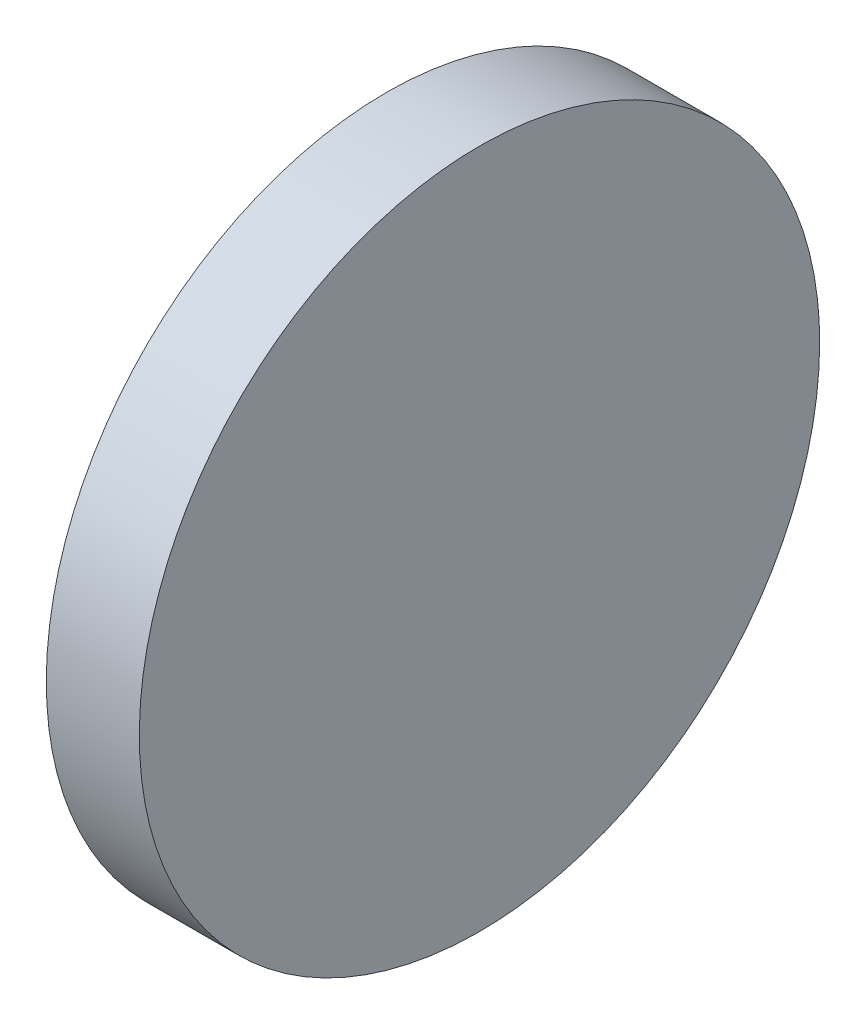
ISO-10303-21;
HEADER;
FILE_DESCRIPTION(('STEP AP214'),'2;1');
FILE_NAME('part.step','',(''),(''),'','','');
FILE_SCHEMA(('AUTOMOTIVE_DESIGN { 1 0 10303 214 1 1 1 1 }'));
ENDSEC;
DATA;
#1=APPLICATION_CONTEXT('core data for automotive mechanical design processes');
#2=APPLICATION_PROTOCOL_DEFINITION('international standard','automotive_design',2000,#1);
#3=PRODUCT_CONTEXT('',#1,'mechanical');
#4=PRODUCT('Part','Part','',(#3));
#5=PRODUCT_RELATED_PRODUCT_CATEGORY('part','',(#4));
#6=PRODUCT_DEFINITION_FORMATION('','',#4);
#7=PRODUCT_DEFINITION_CONTEXT('part definition',#1,'design');
#8=PRODUCT_DEFINITION('design','',#6,#7);
#9=PRODUCT_DEFINITION_SHAPE('','',#8);
#10=(LENGTH_UNIT() NAMED_UNIT(*) SI_UNIT(.MILLI.,.METRE.));
#11=(NAMED_UNIT(*) PLANE_ANGLE_UNIT() SI_UNIT($,.RADIAN.));
#12=(NAMED_UNIT(*) SI_UNIT($,.STERADIAN.) SOLID_ANGLE_UNIT());
#13=UNCERTAINTY_MEASURE_WITH_UNIT(LENGTH_MEASURE(1.E-05),#10,'distance_accuracy_value','');
#14=(GEOMETRIC_REPRESENTATION_CONTEXT(3) GLOBAL_UNCERTAINTY_ASSIGNED_CONTEXT((#13)) GLOBAL_UNIT_ASSIGNED_CONTEXT((#10,
#11,#12)) REPRESENTATION_CONTEXT('',''));
#15=CARTESIAN_POINT('',(0.,0.,0.));
#16=DIRECTION('',(0.,0.,1.));
#17=DIRECTION('',(1.,0.,0.));
#18=AXIS2_PLACEMENT_3D('',#15,#16,#17);
#19=CARTESIAN_POINT('',(1724.54363716145,190.588280016505,-62.7164754960861));
#20=CARTESIAN_POINT('',(1724.54363716145,188.737516544772,-62.7164754960861));
#21=CARTESIAN_POINT('',(1724.54363716145,185.035989601307,-62.3519069128598));
#22=CARTESIAN_POINT('',(1724.54363716145,179.697070593004,-60.732363537643));
#23=CARTESIAN_POINT('',(1724.54363716145,174.776694654986,-58.102367805708));
#24=CARTESIAN_POINT('',(1724.54363716145,170.463949075172,-54.5629889781144));
#25=CARTESIAN_POINT('',(1724.54363716145,166.924570247578,-50.2502433983002));
#26=CARTESIAN_POINT('',(1724.54363716145,164.294574515643,-45.329867460282));
#27=CARTESIAN_POINT('',(1724.54363716145,162.675031140426,-39.9909484519794));
#28=CARTESIAN_POINT('',(1724.54363716145,162.128178265587,-34.4386580367809));
#29=CARTESIAN_POINT('',(1724.54363716145,162.675031140426,-28.8863676215825));
#30=CARTESIAN_POINT('',(1724.54363716145,164.294574515643,-23.5474486132798));
#31=CARTESIAN_POINT('',(1724.54363716145,166.924570247578,-18.6270726752616));
#32=CARTESIAN_POINT('',(1724.54363716145,170.463949075172,-14.3143270954474));
#33=CARTESIAN_POINT('',(1724.54363716145,174.776694654986,-10.7749482678539));
#34=CARTESIAN_POINT('',(1724.54363716145,179.697070593004,-8.14495253591884));
#35=CARTESIAN_POINT('',(1724.54363716145,185.035989601307,-6.52540916070201));
#36=CARTESIAN_POINT('',(1724.54363716145,190.588280016505,-5.97855628586258));
#37=CARTESIAN_POINT('',(1724.54363716145,196.140570431704,-6.52540916070202));
#38=CARTESIAN_POINT('',(1724.54363716145,201.479489440006,-8.14495253591883));
#39=CARTESIAN_POINT('',(1724.54363716145,206.399865378024,-10.7749482678539));
#40=CARTESIAN_POINT('',(1724.54363716145,210.712610957839,-14.3143270954474));
#41=CARTESIAN_POINT('',(1724.54363716145,214.251989785432,-18.6270726752616));
#42=CARTESIAN_POINT('',(1724.54363716145,216.881985517367,-23.5474486132798));
#43=CARTESIAN_POINT('',(1724.54363716145,218.501528892584,-28.8863676215825));
#44=CARTESIAN_POINT('',(1724.54363716145,219.048381767423,-34.4386580367809));
#45=CARTESIAN_POINT('',(1724.54363716145,218.501528892584,-39.9909484519793));
#46=CARTESIAN_POINT('',(1724.54363716145,216.881985517367,-45.3298674602821));
#47=CARTESIAN_POINT('',(1724.54363716145,214.251989785432,-50.2502433983002));
#48=CARTESIAN_POINT('',(1724.54363716145,210.712610957839,-54.5629889781144));
#49=CARTESIAN_POINT('',(1724.54363716145,206.399865378024,-58.102367805708));
#50=CARTESIAN_POINT('',(1724.54363716145,201.479489440006,-60.732363537643));
#51=CARTESIAN_POINT('',(1724.54363716145,196.140570431703,-62.3519069128598));
#52=CARTESIAN_POINT('',(1724.54363716145,192.439043488238,-62.7164754960861));
#53=CARTESIAN_POINT('',(1724.54363716145,190.588280016505,-62.7164754960861));
#54=B_SPLINE_CURVE_WITH_KNOTS('',3,(#19,#20,#21,#22,#23,#24,#25,#26,#27,#28,#29,#30,#31,#32,#33,
#34,#35,#36,#37,#38,#39,#40,#41,#42,#43,#44,#45,#46,#47,#48,#49,#50,#51,#52,#53),.UNSPECIFIED.,
.T.,.F.,(4,1,1,1,1,1,1,1,1,1,1,1,1,1,1,1,1,1,1,1,1,1,1,1,1,1,1,1,1,1,1,1,4),(0.,
0.0312499999999999,0.0625,0.09375,0.125,0.15625,0.1875,0.21875,0.25,0.28125,0.3125,0.34375,
0.375,0.40625,0.4375,0.46875,0.5,0.53125,0.5625,0.59375,0.625,0.65625,0.6875,0.71875,0.75,
0.78125,0.8125,0.84375,0.875,0.90625,0.9375,0.96875,1.),.UNSPECIFIED.);
#55=DIRECTION('',(1.,0.,0.));
#56=VECTOR('',#55,1.);
#57=SURFACE_OF_LINEAR_EXTRUSION('',#54,#56);
#58=CARTESIAN_POINT('',(1724.54363716145,190.588280016505,-62.7164754960861));
#59=CARTESIAN_POINT('',(1724.54363716145,191.050973725528,-62.7164754001135));
#60=CARTESIAN_POINT('',(1724.54363716145,191.513664067124,-62.7050825918024));
#61=CARTESIAN_POINT('',(1724.54363716145,192.437933453871,-62.6596210688691));
#62=CARTESIAN_POINT('',(1724.54363716145,192.899512490361,-62.6255521781037));
#63=CARTESIAN_POINT('',(1724.54363716145,193.820447482561,-62.5348480120364));
#64=CARTESIAN_POINT('',(1724.54363716145,194.279803438271,-62.4782127367344));
#65=CARTESIAN_POINT('',(1724.54363716145,195.195183308172,-62.3424845678351));
#66=CARTESIAN_POINT('',(1724.54363716145,195.651207248216,-62.263391848688));
#67=CARTESIAN_POINT('',(1724.54363716145,196.558809812892,-62.0828584769059));
#68=CARTESIAN_POINT('',(1724.54363716145,197.010388437523,-61.981417824271));
#69=CARTESIAN_POINT('',(1724.54363716145,197.908030150492,-61.7565135660213));
#70=CARTESIAN_POINT('',(1724.54363716145,198.354093195959,-61.6330497893409));
#71=CARTESIAN_POINT('',(1724.54363716145,199.239636905868,-61.3644230421163));
#72=CARTESIAN_POINT('',(1724.54363716145,199.679117570309,-61.2192600715722));
#73=CARTESIAN_POINT('',(1724.54363716145,200.550429492769,-60.9075581095975));
#74=CARTESIAN_POINT('',(1724.54363716145,200.982260810179,-60.7410192842208));
#75=CARTESIAN_POINT('',(1724.54363716145,201.837203713072,-60.3868903388258));
#76=CARTESIAN_POINT('',(1724.54363716145,202.260315298554,-60.1993002188075));
#77=CARTESIAN_POINT('',(1724.54363716145,203.096832438733,-59.8035962206715));
#78=CARTESIAN_POINT('',(1724.54363716145,203.51023791801,-59.5954821831388));
#79=CARTESIAN_POINT('',(1724.54363716145,204.326359673833,-59.1592560163631));
#80=CARTESIAN_POINT('',(1724.54363716145,204.72907595038,-58.93114388712));
#81=CARTESIAN_POINT('',(1724.54363716145,205.522835822806,-58.4554466673194));
#82=CARTESIAN_POINT('',(1724.54363716145,205.913879509332,-58.2078617280384));
#83=CARTESIAN_POINT('',(1724.54363716145,206.683307793982,-57.6937461848247));
#84=CARTESIAN_POINT('',(1724.54363716145,207.061692392106,-57.427215580892));
#85=CARTESIAN_POINT('',(1724.54363716145,207.804938069606,-56.8759185258671));
#86=CARTESIAN_POINT('',(1724.54363716145,208.169799043911,-56.591151933137));
#87=CARTESIAN_POINT('',(1724.54363716145,208.885135745684,-56.0040902736904));
#88=CARTESIAN_POINT('',(1724.54363716145,209.235611473153,-55.7017952069741));
#89=CARTESIAN_POINT('',(1724.54363716145,209.921315548411,-55.0803835067495));
#90=CARTESIAN_POINT('',(1724.54363716145,210.25654401462,-54.7612670039265));
#91=CARTESIAN_POINT('',(1724.54363716145,210.910888983651,-54.1069220348954));
#92=CARTESIAN_POINT('',(1724.54363716145,211.230005486474,-53.7716935686873));
#93=CARTESIAN_POINT('',(1724.54363716145,211.851417186698,-53.0859894934286));
#94=CARTESIAN_POINT('',(1724.54363716145,212.153712253415,-52.73551376596));
#95=CARTESIAN_POINT('',(1724.54363716145,212.740773912861,-52.0201770641869));
#96=CARTESIAN_POINT('',(1724.54363716145,213.025540505591,-51.6553160898823));
#97=CARTESIAN_POINT('',(1724.54363716145,213.576837560616,-50.9120704123817));
#98=CARTESIAN_POINT('',(1724.54363716145,213.843368164549,-50.5336858142576));
#99=CARTESIAN_POINT('',(1724.54363716145,214.357483707762,-49.7642575296081));
#100=CARTESIAN_POINT('',(1724.54363716145,214.605068647044,-49.3732138430827));
#101=CARTESIAN_POINT('',(1724.54363716145,215.080765866844,-48.579453970655));
#102=CARTESIAN_POINT('',(1724.54363716145,215.308877996087,-48.1767376941056));
#103=CARTESIAN_POINT('',(1724.54363716145,215.745104162863,-47.3606159382896));
#104=CARTESIAN_POINT('',(1724.54363716145,215.953218200395,-46.9472104590229));
#105=CARTESIAN_POINT('',(1724.54363716145,216.348922198532,-46.1106933188156));
#106=CARTESIAN_POINT('',(1724.54363716145,216.536512318552,-45.6875817332959));
#107=CARTESIAN_POINT('',(1724.54363716145,216.890641263942,-44.8326388305067));
#108=CARTESIAN_POINT('',(1724.54363716145,217.057180089312,-44.4008075132372));
#109=CARTESIAN_POINT('',(1724.54363716145,217.368882051306,-43.5294955903923));
#110=CARTESIAN_POINT('',(1724.54363716145,217.514045021876,-43.0900149254241));
#111=CARTESIAN_POINT('',(1724.54363716145,217.782671769029,-42.2044712169548));
#112=CARTESIAN_POINT('',(1724.54363716145,217.906135545613,-41.7584081734538));
#113=CARTESIAN_POINT('',(1724.54363716145,218.131039804128,-40.8607664551138));
#114=CARTESIAN_POINT('',(1724.54363716145,218.232480457125,-40.4091878231462));
#115=CARTESIAN_POINT('',(1724.54363716145,218.413013827917,-39.501585278514));
#116=CARTESIAN_POINT('',(1724.54363716145,218.492106545713,-39.0455613658494));
#117=CARTESIAN_POINT('',(1724.54363716145,218.627834718305,-38.1301814211448));
#118=CARTESIAN_POINT('',(1724.54363716145,218.684469998651,-37.6708253632488));
#119=CARTESIAN_POINT('',(1724.54363716145,218.775174150937,-36.7498906502242));
#120=CARTESIAN_POINT('',(1724.54363716145,218.809243022877,-36.2883119950955));
#121=CARTESIAN_POINT('',(1724.54363716145,218.854704597242,-35.3640415664553));
#122=CARTESIAN_POINT('',(1724.54363716145,218.86609747581,-34.9013498016181));
#123=CARTESIAN_POINT('',(1724.54363716145,218.86609747581,-33.9759662719438));
#124=CARTESIAN_POINT('',(1724.54363716145,218.854704597242,-33.5132745071066));
#125=CARTESIAN_POINT('',(1724.54363716145,218.809243022877,-32.5890040784664));
#126=CARTESIAN_POINT('',(1724.54363716145,218.775174150937,-32.1274254233377));
#127=CARTESIAN_POINT('',(1724.54363716145,218.684469998651,-31.206490710313));
#128=CARTESIAN_POINT('',(1724.54363716145,218.627834718305,-30.7471346524171));
#129=CARTESIAN_POINT('',(1724.54363716145,218.492106545713,-29.8317547077125));
#130=CARTESIAN_POINT('',(1724.54363716145,218.413013827917,-29.3757307950479));
#131=CARTESIAN_POINT('',(1724.54363716145,218.232480457125,-28.4681282504157));
#132=CARTESIAN_POINT('',(1724.54363716145,218.131039804128,-28.0165496184481));
#133=CARTESIAN_POINT('',(1724.54363716145,217.906135545613,-27.1189079001081));
#134=CARTESIAN_POINT('',(1724.54363716145,217.782671769029,-26.672844856607));
#135=CARTESIAN_POINT('',(1724.54363716145,217.514045021876,-25.7873011481378));
#136=CARTESIAN_POINT('',(1724.54363716145,217.368882051306,-25.3478204831695));
#137=CARTESIAN_POINT('',(1724.54363716145,217.057180089312,-24.4765085603246));
#138=CARTESIAN_POINT('',(1724.54363716145,216.890641263942,-24.0446772430551));
#139=CARTESIAN_POINT('',(1724.54363716145,216.536512318552,-23.189734340266));
#140=CARTESIAN_POINT('',(1724.54363716145,216.348922198532,-22.7666227547462));
#141=CARTESIAN_POINT('',(1724.54363716145,215.953218200395,-21.9301056145389));
#142=CARTESIAN_POINT('',(1724.54363716145,215.745104162863,-21.5167001352722));
#143=CARTESIAN_POINT('',(1724.54363716145,215.308877996087,-20.7005783794562));
#144=CARTESIAN_POINT('',(1724.54363716145,215.080765866844,-20.2978621029069));
#145=CARTESIAN_POINT('',(1724.54363716145,214.605068647043,-19.5041022304792));
#146=CARTESIAN_POINT('',(1724.54363716145,214.357483707762,-19.1130585439537));
#147=CARTESIAN_POINT('',(1724.54363716145,213.843368164549,-18.3436302593042));
#148=CARTESIAN_POINT('',(1724.54363716145,213.576837560616,-17.9652456611802));
#149=CARTESIAN_POINT('',(1724.54363716145,213.025540505591,-17.2219999836795));
#150=CARTESIAN_POINT('',(1724.54363716145,212.740773912861,-16.8571390093749));
#151=CARTESIAN_POINT('',(1724.54363716145,212.153712253415,-16.1418023076018));
#152=CARTESIAN_POINT('',(1724.54363716145,211.851417186698,-15.7913265801333));
#153=CARTESIAN_POINT('',(1724.54363716145,211.230005486474,-15.1056225048745));
#154=CARTESIAN_POINT('',(1724.54363716145,210.910888983651,-14.7703940386664));
#155=CARTESIAN_POINT('',(1724.54363716145,210.25654401462,-14.1160490696353));
#156=CARTESIAN_POINT('',(1724.54363716145,209.921315548411,-13.7969325668124));
#157=CARTESIAN_POINT('',(1724.54363716145,209.235611473153,-13.1755208665878));
#158=CARTESIAN_POINT('',(1724.54363716145,208.885135745684,-12.8732257998714));
#159=CARTESIAN_POINT('',(1724.54363716145,208.169799043911,-12.2861641404249));
#160=CARTESIAN_POINT('',(1724.54363716145,207.804938069606,-12.0013975476947));
#161=CARTESIAN_POINT('',(1724.54363716145,207.061692392106,-11.4501004926698));
#162=CARTESIAN_POINT('',(1724.54363716145,206.683307793982,-11.1835698887371));
#163=CARTESIAN_POINT('',(1724.54363716145,205.913879509332,-10.6694543455234));
#164=CARTESIAN_POINT('',(1724.54363716145,205.522835822807,-10.4218694062424));
#165=CARTESIAN_POINT('',(1724.54363716145,204.729075950379,-9.94617218644181));
#166=CARTESIAN_POINT('',(1724.54363716145,204.32635967383,-9.71806005719854));
#167=CARTESIAN_POINT('',(1724.54363716145,203.510237918014,-9.28183389042317));
#168=CARTESIAN_POINT('',(1724.54363716145,203.096832438747,-9.07371985289106));
#169=CARTESIAN_POINT('',(1724.54363716145,202.26031529854,-8.67801585475368));
#170=CARTESIAN_POINT('',(1724.54363716145,201.83720371302,-8.49042573473348));
#171=CARTESIAN_POINT('',(1724.54363716145,200.982260810231,-8.13629678934358));
#172=CARTESIAN_POINT('',(1724.54363716145,200.550429492961,-7.96975796397388));
#173=CARTESIAN_POINT('',(1724.54363716145,199.679117570116,-7.65805600198009));
#174=CARTESIAN_POINT('',(1724.54363716145,199.239636905148,-7.51289303141));
#175=CARTESIAN_POINT('',(1724.54363716145,198.354093196679,-7.2442662842565));
#176=CARTESIAN_POINT('',(1724.54363716145,197.908030153178,-7.12080250767309));
#177=CARTESIAN_POINT('',(1724.54363716145,197.010388434838,-6.8958982491583));
#178=CARTESIAN_POINT('',(1724.54363716145,196.55880980287,-6.79445759616121));
#179=CARTESIAN_POINT('',(1724.54363716145,195.651207258238,-6.61392422536862));
#180=CARTESIAN_POINT('',(1724.54363716145,195.195183345574,-6.53483150757312));
#181=CARTESIAN_POINT('',(1724.54363716145,194.279803400869,-6.39910333498111));
#182=CARTESIAN_POINT('',(1724.54363716145,193.820447342973,-6.34246805463487));
#183=CARTESIAN_POINT('',(1724.54363716145,192.899512629948,-6.25176390234874));
#184=CARTESIAN_POINT('',(1724.54363716145,192.43793397482,-6.21769503040885));
#185=CARTESIAN_POINT('',(1724.54363716145,191.513663546179,-6.1722334560436));
#186=CARTESIAN_POINT('',(1724.54363716145,191.050971781342,-6.16084057747573));
#187=CARTESIAN_POINT('',(1724.54363716145,190.125588251668,-6.16084057747572));
#188=CARTESIAN_POINT('',(1724.54363716145,189.662896486831,-6.1722334560436));
#189=CARTESIAN_POINT('',(1724.54363716145,188.73862605819,-6.21769503040885));
#190=CARTESIAN_POINT('',(1724.54363716145,188.277047403062,-6.25176390234873));
#191=CARTESIAN_POINT('',(1724.54363716145,187.356112690037,-6.34246805463486));
#192=CARTESIAN_POINT('',(1724.54363716145,186.896756632141,-6.3991033349811));
#193=CARTESIAN_POINT('',(1724.54363716145,185.981376687437,-6.53483150757311));
#194=CARTESIAN_POINT('',(1724.54363716145,185.525352774772,-6.61392422536861));
#195=CARTESIAN_POINT('',(1724.54363716145,184.61775023014,-6.7944575961612));
#196=CARTESIAN_POINT('',(1724.54363716145,184.166171598172,-6.89589824915829));
#197=CARTESIAN_POINT('',(1724.54363716145,183.268529879832,-7.12080250767309));
#198=CARTESIAN_POINT('',(1724.54363716145,182.822466836331,-7.24426628425649));
#199=CARTESIAN_POINT('',(1724.54363716145,181.936923127862,-7.51289303140999));
#200=CARTESIAN_POINT('',(1724.54363716145,181.497442462894,-7.65805600198008));
#201=CARTESIAN_POINT('',(1724.54363716145,180.626130540049,-7.96975796397388));
#202=CARTESIAN_POINT('',(1724.54363716145,180.194299222779,-8.13629678934358));
#203=CARTESIAN_POINT('',(1724.54363716145,179.33935631999,-8.49042573473348));
#204=CARTESIAN_POINT('',(1724.54363716145,178.91624473447,-8.67801585475368));
#205=CARTESIAN_POINT('',(1724.54363716145,178.079727594263,-9.07371985289106));
#206=CARTESIAN_POINT('',(1724.54363716145,177.666322114996,-9.28183389042318));
#207=CARTESIAN_POINT('',(1724.54363716145,176.85020035918,-9.71806005719855));
#208=CARTESIAN_POINT('',(1724.54363716145,176.447484082631,-9.94617218644181));
#209=CARTESIAN_POINT('',(1724.54363716145,175.653724210203,-10.4218694062424));
#210=CARTESIAN_POINT('',(1724.54363716145,175.262680523678,-10.6694543455234));
#211=CARTESIAN_POINT('',(1724.54363716145,174.493252239028,-11.1835698887371));
#212=CARTESIAN_POINT('',(1724.54363716145,174.114867640904,-11.4501004926698));
#213=CARTESIAN_POINT('',(1724.54363716145,173.371621963404,-12.0013975476947));
#214=CARTESIAN_POINT('',(1724.54363716145,173.006760989099,-12.2861641404249));
#215=CARTESIAN_POINT('',(1724.54363716145,172.291424287326,-12.8732257998714));
#216=CARTESIAN_POINT('',(1724.54363716145,171.940948559857,-13.1755208665878));
#217=CARTESIAN_POINT('',(1724.54363716145,171.255244484599,-13.7969325668124));
#218=CARTESIAN_POINT('',(1724.54363716145,170.920016018391,-14.1160490696353));
#219=CARTESIAN_POINT('',(1724.54363716145,170.265671049359,-14.7703940386664));
#220=CARTESIAN_POINT('',(1724.54363716145,169.946554546537,-15.1056225048745));
#221=CARTESIAN_POINT('',(1724.54363716145,169.325142846312,-15.7913265801333));
#222=CARTESIAN_POINT('',(1724.54363716145,169.022847779596,-16.1418023076018));
#223=CARTESIAN_POINT('',(1724.54363716145,168.435786120149,-16.8571390093749));
#224=CARTESIAN_POINT('',(1724.54363716145,168.151019527419,-17.2219999836795));
#225=CARTESIAN_POINT('',(1724.54363716145,167.599722472394,-17.9652456611802));
#226=CARTESIAN_POINT('',(1724.54363716145,167.333191868461,-18.3436302593042));
#227=CARTESIAN_POINT('',(1724.54363716145,166.819076325248,-19.1130585439537));
#228=CARTESIAN_POINT('',(1724.54363716145,166.571491385967,-19.5041022304792));
#229=CARTESIAN_POINT('',(1724.54363716145,166.095794166166,-20.2978621029069));
#230=CARTESIAN_POINT('',(1724.54363716145,165.867682036923,-20.7005783794562));
#231=CARTESIAN_POINT('',(1724.54363716145,165.431455870147,-21.5167001352722));
#232=CARTESIAN_POINT('',(1724.54363716145,165.223341832615,-21.9301056145389));
#233=CARTESIAN_POINT('',(1724.54363716145,164.827637834478,-22.7666227547462));
#234=CARTESIAN_POINT('',(1724.54363716145,164.640047714458,-23.1897343402659));
#235=CARTESIAN_POINT('',(1724.54363716145,164.285918769068,-24.0446772430551));
#236=CARTESIAN_POINT('',(1724.54363716145,164.119379943698,-24.4765085603246));
#237=CARTESIAN_POINT('',(1724.54363716145,163.807677981704,-25.3478204831695));
#238=CARTESIAN_POINT('',(1724.54363716145,163.662515011134,-25.7873011481378));
#239=CARTESIAN_POINT('',(1724.54363716145,163.393888263981,-26.672844856607));
#240=CARTESIAN_POINT('',(1724.54363716145,163.270424487397,-27.118907900108));
#241=CARTESIAN_POINT('',(1724.54363716145,163.045520228882,-28.0165496184481));
#242=CARTESIAN_POINT('',(1724.54363716145,162.944079575885,-28.4681282504157));
#243=CARTESIAN_POINT('',(1724.54363716145,162.763546205093,-29.3757307950479));
#244=CARTESIAN_POINT('',(1724.54363716145,162.684453487297,-29.8317547077124));
#245=CARTESIAN_POINT('',(1724.54363716145,162.548725314705,-30.747134652417));
#246=CARTESIAN_POINT('',(1724.54363716145,162.492090034359,-31.206490710313));
#247=CARTESIAN_POINT('',(1724.54363716145,162.401385882073,-32.1274254233377));
#248=CARTESIAN_POINT('',(1724.54363716145,162.367317010133,-32.5890040784664));
#249=CARTESIAN_POINT('',(1724.54363716145,162.321855435768,-33.5132745071066));
#250=CARTESIAN_POINT('',(1724.54363716145,162.3104625572,-33.9759662719437));
#251=CARTESIAN_POINT('',(1724.54363716145,162.3104625572,-34.9013498016181));
#252=CARTESIAN_POINT('',(1724.54363716145,162.321855435768,-35.3640415664553));
#253=CARTESIAN_POINT('',(1724.54363716145,162.367317010133,-36.2883119950955));
#254=CARTESIAN_POINT('',(1724.54363716145,162.401385882073,-36.7498906502241));
#255=CARTESIAN_POINT('',(1724.54363716145,162.492090034359,-37.6708253632488));
#256=CARTESIAN_POINT('',(1724.54363716145,162.548725314705,-38.1301814211448));
#257=CARTESIAN_POINT('',(1724.54363716145,162.684453487297,-39.0455613658494));
#258=CARTESIAN_POINT('',(1724.54363716145,162.763546205093,-39.501585278514));
#259=CARTESIAN_POINT('',(1724.54363716145,162.944079575885,-40.4091878231462));
#260=CARTESIAN_POINT('',(1724.54363716145,163.045520228882,-40.8607664551137));
#261=CARTESIAN_POINT('',(1724.54363716145,163.270424487397,-41.7584081734538));
#262=CARTESIAN_POINT('',(1724.54363716145,163.393888263981,-42.2044712169548));
#263=CARTESIAN_POINT('',(1724.54363716145,163.662515011134,-43.0900149254241));
#264=CARTESIAN_POINT('',(1724.54363716145,163.807677981704,-43.5294955903923));
#265=CARTESIAN_POINT('',(1724.54363716145,164.119379943698,-44.4008075132372));
#266=CARTESIAN_POINT('',(1724.54363716145,164.285918769068,-44.8326388305067));
#267=CARTESIAN_POINT('',(1724.54363716145,164.640047714458,-45.6875817332959));
#268=CARTESIAN_POINT('',(1724.54363716145,164.827637834478,-46.1106933188156));
#269=CARTESIAN_POINT('',(1724.54363716145,165.223341832615,-46.9472104590229));
#270=CARTESIAN_POINT('',(1724.54363716145,165.431455870147,-47.3606159382896));
#271=CARTESIAN_POINT('',(1724.54363716145,165.867682036923,-48.1767376941056));
#272=CARTESIAN_POINT('',(1724.54363716145,166.095794166166,-48.579453970655));
#273=CARTESIAN_POINT('',(1724.54363716145,166.571491385967,-49.3732138430827));
#274=CARTESIAN_POINT('',(1724.54363716145,166.819076325248,-49.7642575296081));
#275=CARTESIAN_POINT('',(1724.54363716145,167.333191868461,-50.5336858142576));
#276=CARTESIAN_POINT('',(1724.54363716145,167.599722472394,-50.9120704123817));
#277=CARTESIAN_POINT('',(1724.54363716145,168.151019527419,-51.6553160898823));
#278=CARTESIAN_POINT('',(1724.54363716145,168.435786120149,-52.0201770641869));
#279=CARTESIAN_POINT('',(1724.54363716145,169.022847779596,-52.73551376596));
#280=CARTESIAN_POINT('',(1724.54363716145,169.325142846312,-53.0859894934286));
#281=CARTESIAN_POINT('',(1724.54363716145,169.946554546536,-53.7716935686873));
#282=CARTESIAN_POINT('',(1724.54363716145,170.265671049359,-54.1069220348954));
#283=CARTESIAN_POINT('',(1724.54363716145,170.920016018391,-54.7612670039265));
#284=CARTESIAN_POINT('',(1724.54363716145,171.255244484599,-55.0803835067495));
#285=CARTESIAN_POINT('',(1724.54363716145,171.940948559857,-55.7017952069741));
#286=CARTESIAN_POINT('',(1724.54363716145,172.291424287326,-56.0040902736905));
#287=CARTESIAN_POINT('',(1724.54363716145,173.006760989099,-56.591151933137));
#288=CARTESIAN_POINT('',(1724.54363716145,173.371621963404,-56.8759185258671));
#289=CARTESIAN_POINT('',(1724.54363716145,174.114867640904,-57.427215580892));
#290=CARTESIAN_POINT('',(1724.54363716145,174.493252239028,-57.6937461848247));
#291=CARTESIAN_POINT('',(1724.54363716145,175.262680523678,-58.2078617280384));
#292=CARTESIAN_POINT('',(1724.54363716145,175.653724210204,-58.4554466673194));
#293=CARTESIAN_POINT('',(1724.54363716145,176.44748408263,-58.93114388712));
#294=CARTESIAN_POINT('',(1724.54363716145,176.850200359177,-59.1592560163631));
#295=CARTESIAN_POINT('',(1724.54363716145,177.666322115,-59.5954821831388));
#296=CARTESIAN_POINT('',(1724.54363716145,178.079727594277,-59.8035962206715));
#297=CARTESIAN_POINT('',(1724.54363716145,178.916244734456,-60.1993002188075));
#298=CARTESIAN_POINT('',(1724.54363716145,179.339356319938,-60.3868903388258));
#299=CARTESIAN_POINT('',(1724.54363716145,180.194299222831,-60.7410192842208));
#300=CARTESIAN_POINT('',(1724.54363716145,180.626130540241,-60.9075581095975));
#301=CARTESIAN_POINT('',(1724.54363716145,181.497442462701,-61.2192600715722));
#302=CARTESIAN_POINT('',(1724.54363716145,181.936923127142,-61.3644230421163));
#303=CARTESIAN_POINT('',(1724.54363716145,182.822466837051,-61.6330497893409));
#304=CARTESIAN_POINT('',(1724.54363716145,183.268529882518,-61.7565135660213));
#305=CARTESIAN_POINT('',(1724.54363716145,184.166171595487,-61.981417824271));
#306=CARTESIAN_POINT('',(1724.54363716145,184.617750220118,-62.0828584769059));
#307=CARTESIAN_POINT('',(1724.54363716145,185.525352784794,-62.263391848688));
#308=CARTESIAN_POINT('',(1724.54363716145,185.981376724839,-62.342484567835));
#309=CARTESIAN_POINT('',(1724.54363716145,186.896756594739,-62.4782127367344));
#310=CARTESIAN_POINT('',(1724.54363716145,187.356112550449,-62.5348480120364));
#311=CARTESIAN_POINT('',(1724.54363716145,188.27704754265,-62.6255521781037));
#312=CARTESIAN_POINT('',(1724.54363716145,188.738626579139,-62.6596210688691));
#313=CARTESIAN_POINT('',(1724.54363716145,189.662895965886,-62.7050825918024));
#314=CARTESIAN_POINT('',(1724.54363716145,190.125586307483,-62.7164754001135));
#315=CARTESIAN_POINT('',(1724.54363716145,190.588280016505,-62.7164754960861));
#316=B_SPLINE_CURVE_WITH_KNOTS('',3,(#58,#59,#60,#61,#62,#63,#64,#65,#66,#67,#68,#69,#70,#71,
#72,#73,#74,#75,#76,#77,#78,#79,#80,#81,#82,#83,#84,#85,#86,#87,#88,#89,#90,#91,#92,#93,#94,#95,
#96,#97,#98,#99,#100,#101,#102,#103,#104,#105,#106,#107,#108,#109,#110,#111,#112,#113,#114,#115,
#116,#117,#118,#119,#120,#121,#122,#123,#124,#125,#126,#127,#128,#129,#130,#131,#132,#133,#134,
#135,#136,#137,#138,#139,#140,#141,#142,#143,#144,#145,#146,#147,#148,#149,#150,#151,#152,#153,
#154,#155,#156,#157,#158,#159,#160,#161,#162,#163,#164,#165,#166,#167,#168,#169,#170,#171,#172,
#173,#174,#175,#176,#177,#178,#179,#180,#181,#182,#183,#184,#185,#186,#187,#188,#189,#190,#191,
#192,#193,#194,#195,#196,#197,#198,#199,#200,#201,#202,#203,#204,#205,#206,#207,#208,#209,#210,
#211,#212,#213,#214,#215,#216,#217,#218,#219,#220,#221,#222,#223,#224,#225,#226,#227,#228,#229,
#230,#231,#232,#233,#234,#235,#236,#237,#238,#239,#240,#241,#242,#243,#244,#245,#246,#247,#248,
#249,#250,#251,#252,#253,#254,#255,#256,#257,#258,#259,#260,#261,#262,#263,#264,#265,#266,#267,
#268,#269,#270,#271,#272,#273,#274,#275,#276,#277,#278,#279,#280,#281,#282,#283,#284,#285,#286,
#287,#288,#289,#290,#291,#292,#293,#294,#295,#296,#297,#298,#299,#300,#301,#302,#303,#304,#305,
#306,#307,#308,#309,#310,#311,#312,#313,#314,#315),.UNSPECIFIED.,.F.,.F.,(4,2,2,2,2,2,2,2,2,2,2,
2,2,2,2,2,2,2,2,2,2,2,2,2,2,2,2,2,2,2,2,2,2,2,2,2,2,2,2,2,2,2,2,2,2,2,2,2,2,2,2,2,2,2,2,2,2,2,2,
2,2,2,2,2,2,2,2,2,2,2,2,2,2,2,2,2,2,2,2,2,2,2,2,2,2,2,2,2,2,2,2,2,2,2,2,2,2,2,2,2,2,2,2,2,2,2,2,
2,2,2,2,2,2,2,2,2,2,2,2,2,2,2,2,2,2,2,2,2,4),(0.,1.3879364908246,2.77588376298434,
4.1638310351441,5.55176752596871,6.93970401679332,8.32765128895309,9.71559856111286,
11.1035350519375,12.4914715427621,13.8794188149218,15.2673660870816,16.6553025779062,
18.0432390687309,19.4311863408906,20.8191336130503,22.207070103875,23.5950065946996,
24.9829538668593,26.3709011390191,27.7588376298437,29.1467741206684,30.5347213928281,
31.9226686649878,33.3106051558125,34.6985416466371,36.0864889187968,37.4744361909566,
38.8623726817812,40.2503091726058,41.6382564447656,43.0262037169253,44.4141402077499,
45.8020766985746,47.1900239707343,48.5779712428941,49.9659077337187,51.3538442245433,
52.7417914967031,54.1297387688628,55.5176752596874,56.9056117505121,58.2935590226718,
59.6815062948316,61.0694427856562,62.4573792764808,63.8453265486406,65.2332738208003,
66.6212103116249,68.0091468024495,69.3970940746093,70.785041346769,72.1729778375937,
73.5609143284183,74.948861600578,76.3368088727378,77.7247453635625,79.1126818543871,
80.5006291265468,81.8885763987065,83.2765128895312,84.6644493803558,86.0523966525155,
87.4403439246753,88.8282804154999,90.2162169063246,91.6041641784844,92.9921114506441,
94.3800479414687,95.7679844322934,97.1559317044531,98.5438789766128,99.9318154674375,
101.319751958262,102.707699230422,104.095646502582,105.483582993406,106.871519484231,
108.259466756391,109.64741402855,111.035350519375,112.4232870102,113.811234282359,
115.199181554519,116.587118045344,117.975054536168,119.363001808328,120.750949080488,
122.138885571312,123.526822062137,124.914769334297,126.302716606457,127.690653097281,
129.078589588106,130.466536860266,131.854484132425,133.24242062325,134.630357114075,
136.018304386234,137.406251658394,138.794188149219,140.182124640043,141.570071912203,
142.958019184363,144.345955675187,145.733892166012,147.121839438172,148.509786710332,
149.897723201156,151.285659691981,152.673606964141,154.0615542363,155.449490727125,
156.83742721795,158.225374490109,159.613321762269,161.001258253094,162.389194743918,
163.777142016078,165.165089288238,166.553025779062,167.940962269887,169.328909542047,
170.716856814207,172.104793305031,173.492729795856,174.880677068016,176.268624340175,
177.656560831),.UNSPECIFIED.);
#317=CARTESIAN_POINT('',(1724.54363716145,190.588280016505,-62.7164754960861));
#318=VERTEX_POINT('',#317);
#319=EDGE_CURVE('E9',#318,#318,#316,.F.);
#320=ORIENTED_EDGE('',*,*,#319,.F.);
#321=EDGE_LOOP('',(#320));
#322=FACE_BOUND('',#321,.T.);
#323=CARTESIAN_POINT('',(1732.27593370311,190.588280016505,-62.7164754960861));
#324=CARTESIAN_POINT('',(1732.27593370311,188.737516544772,-62.7164754960861));
#325=CARTESIAN_POINT('',(1732.27593370311,185.035989601307,-62.3519069128598));
#326=CARTESIAN_POINT('',(1732.27593370311,179.697070593004,-60.732363537643));
#327=CARTESIAN_POINT('',(1732.27593370311,174.776694654986,-58.102367805708));
#328=CARTESIAN_POINT('',(1732.27593370311,170.463949075172,-54.5629889781144));
#329=CARTESIAN_POINT('',(1732.27593370311,166.924570247578,-50.2502433983002));
#330=CARTESIAN_POINT('',(1732.27593370311,164.294574515643,-45.329867460282));
#331=CARTESIAN_POINT('',(1732.27593370311,162.675031140426,-39.9909484519794));
#332=CARTESIAN_POINT('',(1732.27593370311,162.128178265587,-34.4386580367809));
#333=CARTESIAN_POINT('',(1732.27593370311,162.675031140426,-28.8863676215825));
#334=CARTESIAN_POINT('',(1732.27593370311,164.294574515643,-23.5474486132798));
#335=CARTESIAN_POINT('',(1732.27593370311,166.924570247578,-18.6270726752616));
#336=CARTESIAN_POINT('',(1732.27593370311,170.463949075172,-14.3143270954474));
#337=CARTESIAN_POINT('',(1732.27593370311,174.776694654986,-10.7749482678539));
#338=CARTESIAN_POINT('',(1732.27593370311,179.697070593004,-8.14495253591884));
#339=CARTESIAN_POINT('',(1732.27593370311,185.035989601307,-6.52540916070201));
#340=CARTESIAN_POINT('',(1732.27593370311,190.588280016505,-5.97855628586258));
#341=CARTESIAN_POINT('',(1732.27593370311,196.140570431704,-6.52540916070202));
#342=CARTESIAN_POINT('',(1732.27593370311,201.479489440006,-8.14495253591883));
#343=CARTESIAN_POINT('',(1732.27593370311,206.399865378024,-10.7749482678539));
#344=CARTESIAN_POINT('',(1732.27593370311,210.712610957839,-14.3143270954474));
#345=CARTESIAN_POINT('',(1732.27593370311,214.251989785432,-18.6270726752616));
#346=CARTESIAN_POINT('',(1732.27593370311,216.881985517367,-23.5474486132798));
#347=CARTESIAN_POINT('',(1732.27593370311,218.501528892584,-28.8863676215825));
#348=CARTESIAN_POINT('',(1732.27593370311,219.048381767423,-34.4386580367809));
#349=CARTESIAN_POINT('',(1732.27593370311,218.501528892584,-39.9909484519793));
#350=CARTESIAN_POINT('',(1732.27593370311,216.881985517367,-45.3298674602821));
#351=CARTESIAN_POINT('',(1732.27593370311,214.251989785432,-50.2502433983002));
#352=CARTESIAN_POINT('',(1732.27593370311,210.712610957839,-54.5629889781144));
#353=CARTESIAN_POINT('',(1732.27593370311,206.399865378024,-58.102367805708));
#354=CARTESIAN_POINT('',(1732.27593370311,201.479489440006,-60.732363537643));
#355=CARTESIAN_POINT('',(1732.27593370311,196.140570431703,-62.3519069128598));
#356=CARTESIAN_POINT('',(1732.27593370311,192.439043488238,-62.7164754960861));
#357=CARTESIAN_POINT('',(1732.27593370311,190.588280016505,-62.7164754960861));
#358=B_SPLINE_CURVE_WITH_KNOTS('',3,(#323,#324,#325,#326,#327,#328,#329,#330,#331,#332,#333,
#334,#335,#336,#337,#338,#339,#340,#341,#342,#343,#344,#345,#346,#347,#348,#349,#350,#351,#352,
#353,#354,#355,#356,#357),.UNSPECIFIED.,.T.,.F.,(4,1,1,1,1,1,1,1,1,1,1,1,1,1,1,1,1,1,1,1,1,1,1,
1,1,1,1,1,1,1,1,1,4),(0.,0.0312499999999999,0.0625,0.09375,0.125,0.15625,0.1875,0.21875,0.25,
0.28125,0.3125,0.34375,0.375,0.40625,0.4375,0.46875,0.5,0.53125,0.5625,0.59375,0.625,0.65625,
0.6875,0.71875,0.75,0.78125,0.8125,0.84375,0.875,0.90625,0.9375,0.96875,1.),.UNSPECIFIED.);
#359=CARTESIAN_POINT('',(1732.27593370311,190.588280016505,-62.7164754960861));
#360=VERTEX_POINT('',#359);
#361=EDGE_CURVE('E24',#360,#360,#358,.T.);
#362=ORIENTED_EDGE('',*,*,#361,.T.);
#363=EDGE_LOOP('',(#362));
#364=FACE_BOUND('',#363,.T.);
#365=ADVANCED_FACE('F14',(#322,#364),#57,.F.);
#366=CARTESIAN_POINT('',(1724.54363716145,218.088280016505,-34.4386580367809));
#367=DIRECTION('',(1.,0.,0.));
#368=DIRECTION('',(0.,1.,0.));
#369=AXIS2_PLACEMENT_3D('',#366,#367,#368);
#370=PLANE('',#369);
#371=ORIENTED_EDGE('',*,*,#319,.T.);
#372=EDGE_LOOP('',(#371));
#373=FACE_BOUND('',#372,.T.);
#374=ADVANCED_FACE('F59',(#373),#370,.F.);
#375=CARTESIAN_POINT('',(1732.27593370311,218.088280016505,-34.4386580367809));
#376=DIRECTION('',(1.,0.,0.));
#377=DIRECTION('',(0.,1.,0.));
#378=AXIS2_PLACEMENT_3D('',#375,#376,#377);
#379=PLANE('',#378);
#380=ORIENTED_EDGE('',*,*,#361,.F.);
#381=EDGE_LOOP('',(#380));
#382=FACE_BOUND('',#381,.T.);
#383=ADVANCED_FACE('F67',(#382),#379,.T.);
#384=CLOSED_SHELL('',(#365,#374,#383));
#385=MANIFOLD_SOLID_BREP('B1',#384);
#386=ADVANCED_BREP_SHAPE_REPRESENTATION('',(#18,#385),#14);
#387=SHAPE_DEFINITION_REPRESENTATION(#9,#386);
ENDSEC;
END-ISO-10303-21;
